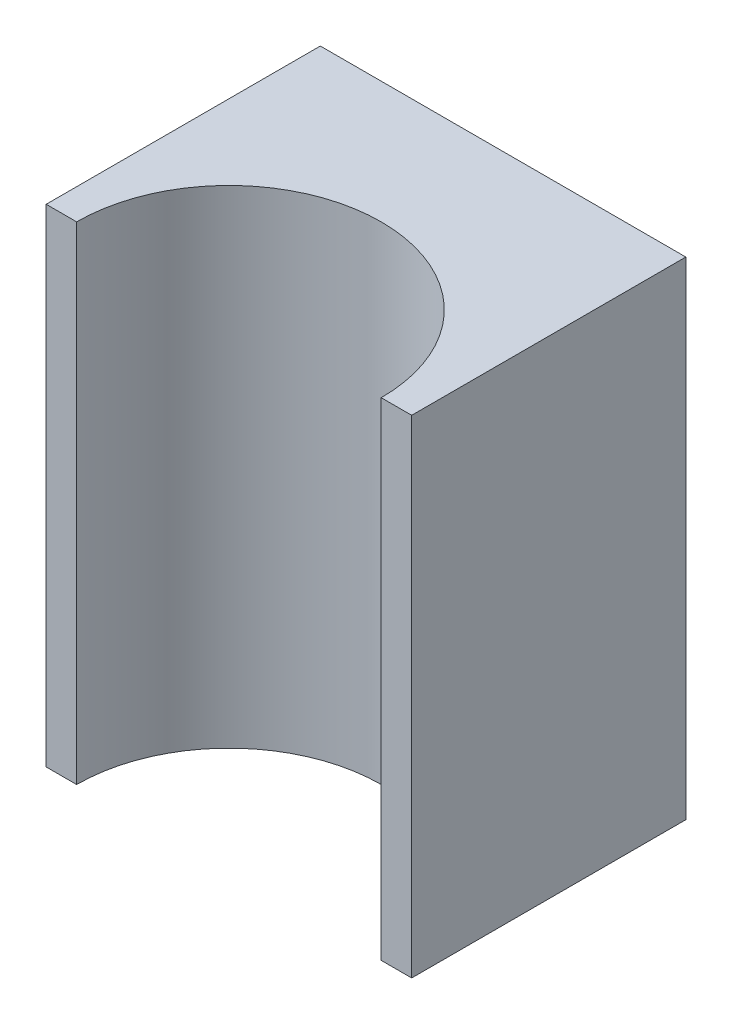
ISO-10303-21;
HEADER;
FILE_DESCRIPTION(('STEP AP214'),'2;1');
FILE_NAME('part.step','',(''),(''),'','','');
FILE_SCHEMA(('AUTOMOTIVE_DESIGN { 1 0 10303 214 1 1 1 1 }'));
ENDSEC;
DATA;
#1=APPLICATION_CONTEXT('core data for automotive mechanical design processes');
#2=APPLICATION_PROTOCOL_DEFINITION('international standard','automotive_design',2000,#1);
#3=PRODUCT_CONTEXT('',#1,'mechanical');
#4=PRODUCT('Part','Part','',(#3));
#5=PRODUCT_RELATED_PRODUCT_CATEGORY('part','',(#4));
#6=PRODUCT_DEFINITION_FORMATION('','',#4);
#7=PRODUCT_DEFINITION_CONTEXT('part definition',#1,'design');
#8=PRODUCT_DEFINITION('design','',#6,#7);
#9=PRODUCT_DEFINITION_SHAPE('','',#8);
#10=(LENGTH_UNIT() NAMED_UNIT(*) SI_UNIT(.MILLI.,.METRE.));
#11=(NAMED_UNIT(*) PLANE_ANGLE_UNIT() SI_UNIT($,.RADIAN.));
#12=(NAMED_UNIT(*) SI_UNIT($,.STERADIAN.) SOLID_ANGLE_UNIT());
#13=UNCERTAINTY_MEASURE_WITH_UNIT(LENGTH_MEASURE(1.E-05),#10,'distance_accuracy_value','');
#14=(GEOMETRIC_REPRESENTATION_CONTEXT(3) GLOBAL_UNCERTAINTY_ASSIGNED_CONTEXT((#13)) GLOBAL_UNIT_ASSIGNED_CONTEXT((#10,
#11,#12)) REPRESENTATION_CONTEXT('',''));
#15=CARTESIAN_POINT('',(0.,0.,0.));
#16=DIRECTION('',(0.,0.,1.));
#17=DIRECTION('',(1.,0.,0.));
#18=AXIS2_PLACEMENT_3D('',#15,#16,#17);
#19=CARTESIAN_POINT('',(0.3,0.8,-0.225));
#20=DIRECTION('',(-1.,0.,0.));
#21=DIRECTION('',(0.,0.,1.));
#22=AXIS2_PLACEMENT_3D('',#19,#20,#21);
#23=PLANE('',#22);
#24=DIRECTION('',(0.,0.,-1.));
#25=VECTOR('',#24,1.);
#26=CARTESIAN_POINT('',(0.3,0.,-0.225));
#27=LINE('',#26,#25);
#28=CARTESIAN_POINT('',(0.3,0.,0.225));
#29=VERTEX_POINT('',#28);
#30=CARTESIAN_POINT('',(0.3,0.,-0.225));
#31=VERTEX_POINT('',#30);
#32=EDGE_CURVE('E116',#29,#31,#27,.T.);
#33=ORIENTED_EDGE('',*,*,#32,.T.);
#34=DIRECTION('',(0.,-1.,0.));
#35=VECTOR('',#34,1.);
#36=CARTESIAN_POINT('',(0.3,0.8,-0.225));
#37=LINE('',#36,#35);
#38=CARTESIAN_POINT('',(0.3,0.8,-0.225));
#39=VERTEX_POINT('',#38);
#40=EDGE_CURVE('E11',#39,#31,#37,.T.);
#41=ORIENTED_EDGE('',*,*,#40,.F.);
#42=DIRECTION('',(0.,0.,-1.));
#43=VECTOR('',#42,1.);
#44=CARTESIAN_POINT('',(0.3,0.8,-0.225));
#45=LINE('',#44,#43);
#46=CARTESIAN_POINT('',(0.3,0.8,0.225));
#47=VERTEX_POINT('',#46);
#48=EDGE_CURVE('E126',#47,#39,#45,.T.);
#49=ORIENTED_EDGE('',*,*,#48,.F.);
#50=DIRECTION('',(0.,-1.,0.));
#51=VECTOR('',#50,1.);
#52=CARTESIAN_POINT('',(0.3,0.8,0.225));
#53=LINE('',#52,#51);
#54=EDGE_CURVE('E112',#47,#29,#53,.T.);
#55=ORIENTED_EDGE('',*,*,#54,.T.);
#56=EDGE_LOOP('',(#33,#41,#49,#55));
#57=FACE_BOUND('',#56,.T.);
#58=ADVANCED_FACE('F32',(#57),#23,.F.);
#59=CARTESIAN_POINT('',(-0.3,0.8,-0.225));
#60=DIRECTION('',(0.,0.,1.));
#61=DIRECTION('',(1.,0.,0.));
#62=AXIS2_PLACEMENT_3D('',#59,#60,#61);
#63=PLANE('',#62);
#64=DIRECTION('',(-1.,0.,0.));
#65=VECTOR('',#64,1.);
#66=CARTESIAN_POINT('',(-0.3,0.,-0.225));
#67=LINE('',#66,#65);
#68=CARTESIAN_POINT('',(-0.3,0.,-0.225));
#69=VERTEX_POINT('',#68);
#70=EDGE_CURVE('E119',#31,#69,#67,.T.);
#71=ORIENTED_EDGE('',*,*,#70,.T.);
#72=DIRECTION('',(0.,-1.,0.));
#73=VECTOR('',#72,1.);
#74=CARTESIAN_POINT('',(-0.3,0.8,-0.225));
#75=LINE('',#74,#73);
#76=CARTESIAN_POINT('',(-0.3,0.8,-0.225));
#77=VERTEX_POINT('',#76);
#78=EDGE_CURVE('E40',#77,#69,#75,.T.);
#79=ORIENTED_EDGE('',*,*,#78,.F.);
#80=DIRECTION('',(-1.,0.,0.));
#81=VECTOR('',#80,1.);
#82=CARTESIAN_POINT('',(-0.3,0.8,-0.225));
#83=LINE('',#82,#81);
#84=EDGE_CURVE('E85',#39,#77,#83,.T.);
#85=ORIENTED_EDGE('',*,*,#84,.F.);
#86=ORIENTED_EDGE('',*,*,#40,.T.);
#87=EDGE_LOOP('',(#71,#79,#85,#86));
#88=FACE_BOUND('',#87,.T.);
#89=ADVANCED_FACE('F150',(#88),#63,.F.);
#90=CARTESIAN_POINT('',(-0.3,0.8,-0.225));
#91=DIRECTION('',(1.,0.,0.));
#92=DIRECTION('',(0.,0.,-1.));
#93=AXIS2_PLACEMENT_3D('',#90,#91,#92);
#94=PLANE('',#93);
#95=DIRECTION('',(0.,0.,1.));
#96=VECTOR('',#95,1.);
#97=CARTESIAN_POINT('',(-0.3,0.,-0.225));
#98=LINE('',#97,#96);
#99=CARTESIAN_POINT('',(-0.3,0.,0.225));
#100=VERTEX_POINT('',#99);
#101=EDGE_CURVE('E121',#69,#100,#98,.T.);
#102=ORIENTED_EDGE('',*,*,#101,.T.);
#103=DIRECTION('',(0.,-1.,0.));
#104=VECTOR('',#103,1.);
#105=CARTESIAN_POINT('',(-0.3,0.8,0.225));
#106=LINE('',#105,#104);
#107=CARTESIAN_POINT('',(-0.3,0.8,0.225));
#108=VERTEX_POINT('',#107);
#109=EDGE_CURVE('E107',#108,#100,#106,.T.);
#110=ORIENTED_EDGE('',*,*,#109,.F.);
#111=DIRECTION('',(0.,0.,1.));
#112=VECTOR('',#111,1.);
#113=CARTESIAN_POINT('',(-0.3,0.8,-0.225));
#114=LINE('',#113,#112);
#115=EDGE_CURVE('E98',#77,#108,#114,.T.);
#116=ORIENTED_EDGE('',*,*,#115,.F.);
#117=ORIENTED_EDGE('',*,*,#78,.T.);
#118=EDGE_LOOP('',(#102,#110,#116,#117));
#119=FACE_BOUND('',#118,.T.);
#120=ADVANCED_FACE('F132',(#119),#94,.F.);
#121=CARTESIAN_POINT('',(-0.3,0.8,0.225));
#122=DIRECTION('',(0.,0.,-1.));
#123=DIRECTION('',(-1.,0.,0.));
#124=AXIS2_PLACEMENT_3D('',#121,#122,#123);
#125=PLANE('',#124);
#126=DIRECTION('',(1.,0.,0.));
#127=VECTOR('',#126,1.);
#128=CARTESIAN_POINT('',(-0.3,0.,0.225));
#129=LINE('',#128,#127);
#130=CARTESIAN_POINT('',(-0.25,0.,0.225));
#131=VERTEX_POINT('',#130);
#132=EDGE_CURVE('E106',#100,#131,#129,.T.);
#133=ORIENTED_EDGE('',*,*,#132,.T.);
#134=DIRECTION('',(0.,-1.,0.));
#135=VECTOR('',#134,1.);
#136=CARTESIAN_POINT('',(-0.25,0.8,0.225));
#137=LINE('',#136,#135);
#138=CARTESIAN_POINT('',(-0.25,0.8,0.225));
#139=VERTEX_POINT('',#138);
#140=EDGE_CURVE('E103',#139,#131,#137,.T.);
#141=ORIENTED_EDGE('',*,*,#140,.F.);
#142=DIRECTION('',(1.,0.,0.));
#143=VECTOR('',#142,1.);
#144=CARTESIAN_POINT('',(-0.3,0.8,0.225));
#145=LINE('',#144,#143);
#146=EDGE_CURVE('E92',#108,#139,#145,.T.);
#147=ORIENTED_EDGE('',*,*,#146,.F.);
#148=ORIENTED_EDGE('',*,*,#109,.T.);
#149=EDGE_LOOP('',(#133,#141,#147,#148));
#150=FACE_BOUND('',#149,.T.);
#151=ADVANCED_FACE('F104',(#150),#125,.F.);
#152=CARTESIAN_POINT('',(0.,0.8,0.225));
#153=DIRECTION('',(0.,-1.,0.));
#154=DIRECTION('',(0.,0.,-1.));
#155=AXIS2_PLACEMENT_3D('',#152,#153,#154);
#156=CYLINDRICAL_SURFACE('',#155,0.25);
#157=CARTESIAN_POINT('',(0.,0.,0.225));
#158=DIRECTION('',(0.,-1.,0.));
#159=DIRECTION('',(0.,0.,1.));
#160=AXIS2_PLACEMENT_3D('',#157,#158,#159);
#161=CIRCLE('',#160,0.25);
#162=CARTESIAN_POINT('',(0.25,0.,0.225));
#163=VERTEX_POINT('',#162);
#164=EDGE_CURVE('E71',#131,#163,#161,.T.);
#165=ORIENTED_EDGE('',*,*,#164,.T.);
#166=DIRECTION('',(0.,-1.,0.));
#167=VECTOR('',#166,1.);
#168=CARTESIAN_POINT('',(0.25,0.8,0.225));
#169=LINE('',#168,#167);
#170=CARTESIAN_POINT('',(0.25,0.8,0.225));
#171=VERTEX_POINT('',#170);
#172=EDGE_CURVE('E108',#171,#163,#169,.T.);
#173=ORIENTED_EDGE('',*,*,#172,.F.);
#174=CARTESIAN_POINT('',(0.,0.8,0.225));
#175=DIRECTION('',(0.,-1.,0.));
#176=DIRECTION('',(0.,0.,1.));
#177=AXIS2_PLACEMENT_3D('',#174,#175,#176);
#178=CIRCLE('',#177,0.25);
#179=EDGE_CURVE('E96',#139,#171,#178,.T.);
#180=ORIENTED_EDGE('',*,*,#179,.F.);
#181=ORIENTED_EDGE('',*,*,#140,.T.);
#182=EDGE_LOOP('',(#165,#173,#180,#181));
#183=FACE_BOUND('',#182,.T.);
#184=ADVANCED_FACE('F110',(#183),#156,.F.);
#185=CARTESIAN_POINT('',(0.25,0.8,0.225));
#186=DIRECTION('',(0.,0.,-1.));
#187=DIRECTION('',(-1.,0.,0.));
#188=AXIS2_PLACEMENT_3D('',#185,#186,#187);
#189=PLANE('',#188);
#190=DIRECTION('',(1.,0.,0.));
#191=VECTOR('',#190,1.);
#192=CARTESIAN_POINT('',(0.25,0.,0.225));
#193=LINE('',#192,#191);
#194=EDGE_CURVE('E77',#163,#29,#193,.T.);
#195=ORIENTED_EDGE('',*,*,#194,.T.);
#196=ORIENTED_EDGE('',*,*,#54,.F.);
#197=DIRECTION('',(1.,0.,0.));
#198=VECTOR('',#197,1.);
#199=CARTESIAN_POINT('',(0.25,0.8,0.225));
#200=LINE('',#199,#198);
#201=EDGE_CURVE('E48',#171,#47,#200,.T.);
#202=ORIENTED_EDGE('',*,*,#201,.F.);
#203=ORIENTED_EDGE('',*,*,#172,.T.);
#204=EDGE_LOOP('',(#195,#196,#202,#203));
#205=FACE_BOUND('',#204,.T.);
#206=ADVANCED_FACE('F139',(#205),#189,.F.);
#207=CARTESIAN_POINT('',(0.,0.8,0.225));
#208=DIRECTION('',(0.,1.,0.));
#209=DIRECTION('',(0.,0.,1.));
#210=AXIS2_PLACEMENT_3D('',#207,#208,#209);
#211=PLANE('',#210);
#212=ORIENTED_EDGE('',*,*,#48,.T.);
#213=ORIENTED_EDGE('',*,*,#84,.T.);
#214=ORIENTED_EDGE('',*,*,#115,.T.);
#215=ORIENTED_EDGE('',*,*,#146,.T.);
#216=ORIENTED_EDGE('',*,*,#179,.T.);
#217=ORIENTED_EDGE('',*,*,#201,.T.);
#218=EDGE_LOOP('',(#212,#213,#214,#215,#216,#217));
#219=FACE_BOUND('',#218,.T.);
#220=ADVANCED_FACE('F94',(#219),#211,.T.);
#221=CARTESIAN_POINT('',(0.,0.,0.225));
#222=DIRECTION('',(0.,1.,0.));
#223=DIRECTION('',(0.,0.,1.));
#224=AXIS2_PLACEMENT_3D('',#221,#222,#223);
#225=PLANE('',#224);
#226=ORIENTED_EDGE('',*,*,#32,.F.);
#227=ORIENTED_EDGE('',*,*,#194,.F.);
#228=ORIENTED_EDGE('',*,*,#164,.F.);
#229=ORIENTED_EDGE('',*,*,#132,.F.);
#230=ORIENTED_EDGE('',*,*,#101,.F.);
#231=ORIENTED_EDGE('',*,*,#70,.F.);
#232=EDGE_LOOP('',(#226,#227,#228,#229,#230,#231));
#233=FACE_BOUND('',#232,.T.);
#234=ADVANCED_FACE('F135',(#233),#225,.F.);
#235=CLOSED_SHELL('',(#58,#89,#120,#151,#184,#206,#220,#234));
#236=MANIFOLD_SOLID_BREP('B2',#235);
#237=ADVANCED_BREP_SHAPE_REPRESENTATION('',(#18,#236),#14);
#238=SHAPE_DEFINITION_REPRESENTATION(#9,#237);
ENDSEC;
END-ISO-10303-21;
